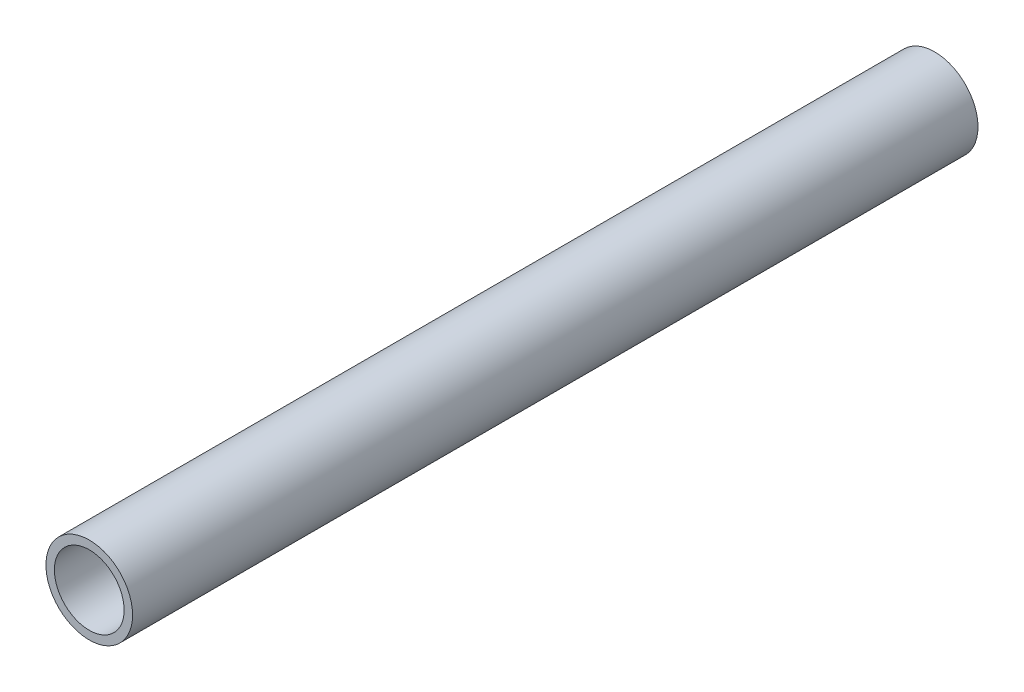
ISO-10303-21;
HEADER;
FILE_DESCRIPTION(('STEP AP214'),'2;1');
FILE_NAME('part.step','',(''),(''),'','','');
FILE_SCHEMA(('AUTOMOTIVE_DESIGN { 1 0 10303 214 1 1 1 1 }'));
ENDSEC;
DATA;
#1=APPLICATION_CONTEXT('core data for automotive mechanical design processes');
#2=APPLICATION_PROTOCOL_DEFINITION('international standard','automotive_design',2000,#1);
#3=PRODUCT_CONTEXT('',#1,'mechanical');
#4=PRODUCT('Part','Part','',(#3));
#5=PRODUCT_RELATED_PRODUCT_CATEGORY('part','',(#4));
#6=PRODUCT_DEFINITION_FORMATION('','',#4);
#7=PRODUCT_DEFINITION_CONTEXT('part definition',#1,'design');
#8=PRODUCT_DEFINITION('design','',#6,#7);
#9=PRODUCT_DEFINITION_SHAPE('','',#8);
#10=(LENGTH_UNIT() NAMED_UNIT(*) SI_UNIT(.MILLI.,.METRE.));
#11=(NAMED_UNIT(*) PLANE_ANGLE_UNIT() SI_UNIT($,.RADIAN.));
#12=(NAMED_UNIT(*) SI_UNIT($,.STERADIAN.) SOLID_ANGLE_UNIT());
#13=UNCERTAINTY_MEASURE_WITH_UNIT(LENGTH_MEASURE(1.E-05),#10,'distance_accuracy_value','');
#14=(GEOMETRIC_REPRESENTATION_CONTEXT(3) GLOBAL_UNCERTAINTY_ASSIGNED_CONTEXT((#13)) GLOBAL_UNIT_ASSIGNED_CONTEXT((#10,
#11,#12)) REPRESENTATION_CONTEXT('',''));
#15=CARTESIAN_POINT('',(0.,0.,0.));
#16=DIRECTION('',(0.,0.,1.));
#17=DIRECTION('',(1.,0.,0.));
#18=AXIS2_PLACEMENT_3D('',#15,#16,#17);
#19=CARTESIAN_POINT('',(0.,0.,200.));
#20=DIRECTION('',(0.,0.,1.));
#21=DIRECTION('',(1.,0.,0.));
#22=AXIS2_PLACEMENT_3D('',#19,#20,#21);
#23=PLANE('',#22);
#24=CARTESIAN_POINT('',(0.,0.,200.));
#25=DIRECTION('',(0.,0.,1.));
#26=DIRECTION('',(1.,0.,0.));
#27=AXIS2_PLACEMENT_3D('',#24,#25,#26);
#28=CIRCLE('',#27,10.25);
#29=CARTESIAN_POINT('',(10.25,0.,200.));
#30=VERTEX_POINT('',#29);
#31=EDGE_CURVE('E10',#30,#30,#28,.T.);
#32=ORIENTED_EDGE('',*,*,#31,.T.);
#33=EDGE_LOOP('',(#32));
#34=FACE_BOUND('',#33,.T.);
#35=CARTESIAN_POINT('',(0.,0.,200.));
#36=DIRECTION('',(0.,0.,1.));
#37=DIRECTION('',(1.,0.,0.));
#38=AXIS2_PLACEMENT_3D('',#35,#36,#37);
#39=CIRCLE('',#38,8.25);
#40=CARTESIAN_POINT('',(8.25,0.,200.));
#41=VERTEX_POINT('',#40);
#42=EDGE_CURVE('E44',#41,#41,#39,.T.);
#43=ORIENTED_EDGE('',*,*,#42,.F.);
#44=EDGE_LOOP('',(#43));
#45=FACE_BOUND('',#44,.T.);
#46=ADVANCED_FACE('F33',(#34,#45),#23,.T.);
#47=CARTESIAN_POINT('',(0.,0.,0.));
#48=DIRECTION('',(0.,0.,1.));
#49=DIRECTION('',(1.,0.,0.));
#50=AXIS2_PLACEMENT_3D('',#47,#48,#49);
#51=PLANE('',#50);
#52=CARTESIAN_POINT('',(0.,0.,0.));
#53=DIRECTION('',(0.,0.,1.));
#54=DIRECTION('',(1.,0.,0.));
#55=AXIS2_PLACEMENT_3D('',#52,#53,#54);
#56=CIRCLE('',#55,10.25);
#57=CARTESIAN_POINT('',(10.25,0.,0.));
#58=VERTEX_POINT('',#57);
#59=EDGE_CURVE('E37',#58,#58,#56,.T.);
#60=ORIENTED_EDGE('',*,*,#59,.F.);
#61=EDGE_LOOP('',(#60));
#62=FACE_BOUND('',#61,.T.);
#63=CARTESIAN_POINT('',(0.,0.,0.));
#64=DIRECTION('',(0.,0.,1.));
#65=DIRECTION('',(1.,0.,0.));
#66=AXIS2_PLACEMENT_3D('',#63,#64,#65);
#67=CIRCLE('',#66,8.25);
#68=CARTESIAN_POINT('',(8.25,0.,0.));
#69=VERTEX_POINT('',#68);
#70=EDGE_CURVE('E46',#69,#69,#67,.T.);
#71=ORIENTED_EDGE('',*,*,#70,.T.);
#72=EDGE_LOOP('',(#71));
#73=FACE_BOUND('',#72,.T.);
#74=ADVANCED_FACE('F56',(#62,#73),#51,.F.);
#75=CARTESIAN_POINT('',(0.,0.,200.));
#76=DIRECTION('',(0.,0.,-1.));
#77=DIRECTION('',(-1.,0.,0.));
#78=AXIS2_PLACEMENT_3D('',#75,#76,#77);
#79=CYLINDRICAL_SURFACE('',#78,10.25);
#80=ORIENTED_EDGE('',*,*,#31,.F.);
#81=EDGE_LOOP('',(#80));
#82=FACE_BOUND('',#81,.T.);
#83=ORIENTED_EDGE('',*,*,#59,.T.);
#84=EDGE_LOOP('',(#83));
#85=FACE_BOUND('',#84,.T.);
#86=ADVANCED_FACE('F35',(#82,#85),#79,.T.);
#87=CARTESIAN_POINT('',(0.,0.,200.));
#88=DIRECTION('',(0.,0.,-1.));
#89=DIRECTION('',(-1.,0.,0.));
#90=AXIS2_PLACEMENT_3D('',#87,#88,#89);
#91=CYLINDRICAL_SURFACE('',#90,8.25);
#92=ORIENTED_EDGE('',*,*,#42,.T.);
#93=EDGE_LOOP('',(#92));
#94=FACE_BOUND('',#93,.T.);
#95=ORIENTED_EDGE('',*,*,#70,.F.);
#96=EDGE_LOOP('',(#95));
#97=FACE_BOUND('',#96,.T.);
#98=ADVANCED_FACE('F52',(#94,#97),#91,.F.);
#99=CLOSED_SHELL('',(#46,#74,#86,#98));
#100=MANIFOLD_SOLID_BREP('B2',#99);
#101=ADVANCED_BREP_SHAPE_REPRESENTATION('',(#18,#100),#14);
#102=SHAPE_DEFINITION_REPRESENTATION(#9,#101);
ENDSEC;
END-ISO-10303-21;
